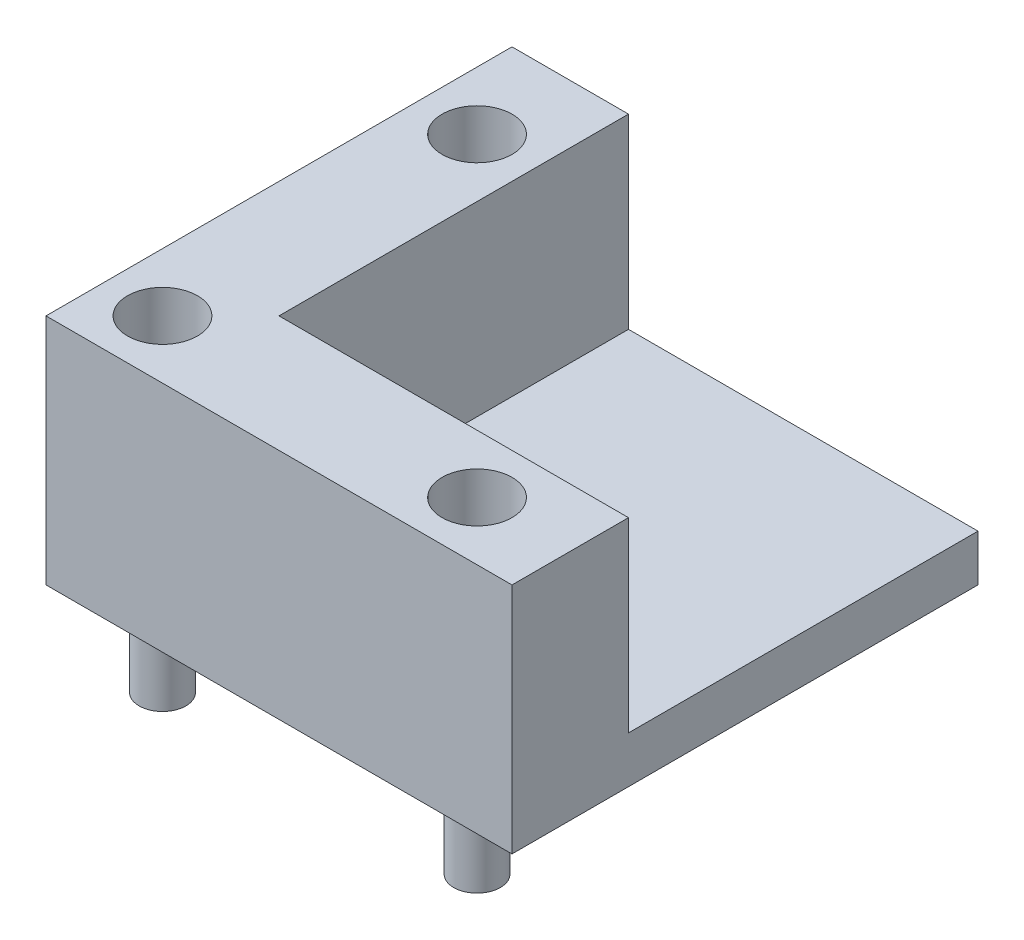
ISO-10303-21;
HEADER;
FILE_DESCRIPTION(('STEP AP214'),'2;1');
FILE_NAME('part.step','',(''),(''),'','','');
FILE_SCHEMA(('AUTOMOTIVE_DESIGN { 1 0 10303 214 1 1 1 1 }'));
ENDSEC;
DATA;
#1=APPLICATION_CONTEXT('core data for automotive mechanical design processes');
#2=APPLICATION_PROTOCOL_DEFINITION('international standard','automotive_design',2000,#1);
#3=PRODUCT_CONTEXT('',#1,'mechanical');
#4=PRODUCT('Part','Part','',(#3));
#5=PRODUCT_RELATED_PRODUCT_CATEGORY('part','',(#4));
#6=PRODUCT_DEFINITION_FORMATION('','',#4);
#7=PRODUCT_DEFINITION_CONTEXT('part definition',#1,'design');
#8=PRODUCT_DEFINITION('design','',#6,#7);
#9=PRODUCT_DEFINITION_SHAPE('','',#8);
#10=(LENGTH_UNIT() NAMED_UNIT(*) SI_UNIT(.MILLI.,.METRE.));
#11=(NAMED_UNIT(*) PLANE_ANGLE_UNIT() SI_UNIT($,.RADIAN.));
#12=(NAMED_UNIT(*) SI_UNIT($,.STERADIAN.) SOLID_ANGLE_UNIT());
#13=UNCERTAINTY_MEASURE_WITH_UNIT(LENGTH_MEASURE(1.E-05),#10,'distance_accuracy_value','');
#14=(GEOMETRIC_REPRESENTATION_CONTEXT(3) GLOBAL_UNCERTAINTY_ASSIGNED_CONTEXT((#13)) GLOBAL_UNIT_ASSIGNED_CONTEXT((#10,
#11,#12)) REPRESENTATION_CONTEXT('',''));
#15=CARTESIAN_POINT('',(0.,0.,0.));
#16=DIRECTION('',(0.,0.,1.));
#17=DIRECTION('',(1.,0.,0.));
#18=AXIS2_PLACEMENT_3D('',#15,#16,#17);
#19=CARTESIAN_POINT('',(0.,2.54,0.));
#20=DIRECTION('',(0.,-1.,0.));
#21=DIRECTION('',(0.,0.,-1.));
#22=AXIS2_PLACEMENT_3D('',#19,#20,#21);
#23=PLANE('',#22);
#24=DIRECTION('',(0.,0.,-1.));
#25=VECTOR('',#24,1.);
#26=CARTESIAN_POINT('',(6.35,2.54,-25.4));
#27=LINE('',#26,#25);
#28=CARTESIAN_POINT('',(6.35,2.54,-6.35));
#29=VERTEX_POINT('',#28);
#30=CARTESIAN_POINT('',(6.35,2.54,-25.4));
#31=VERTEX_POINT('',#30);
#32=EDGE_CURVE('E122',#29,#31,#27,.T.);
#33=ORIENTED_EDGE('',*,*,#32,.F.);
#34=DIRECTION('',(-1.,0.,0.));
#35=VECTOR('',#34,1.);
#36=CARTESIAN_POINT('',(6.35,2.54,-6.35));
#37=LINE('',#36,#35);
#38=CARTESIAN_POINT('',(25.4,2.54,-6.35));
#39=VERTEX_POINT('',#38);
#40=EDGE_CURVE('E59',#39,#29,#37,.T.);
#41=ORIENTED_EDGE('',*,*,#40,.F.);
#42=DIRECTION('',(0.,0.,-1.));
#43=VECTOR('',#42,1.);
#44=CARTESIAN_POINT('',(25.4,2.54,0.));
#45=LINE('',#44,#43);
#46=CARTESIAN_POINT('',(25.4,2.54,-25.4));
#47=VERTEX_POINT('',#46);
#48=EDGE_CURVE('E146',#39,#47,#45,.T.);
#49=ORIENTED_EDGE('',*,*,#48,.T.);
#50=DIRECTION('',(-1.,0.,0.));
#51=VECTOR('',#50,1.);
#52=CARTESIAN_POINT('',(0.,2.54,-25.4));
#53=LINE('',#52,#51);
#54=EDGE_CURVE('E54',#47,#31,#53,.T.);
#55=ORIENTED_EDGE('',*,*,#54,.T.);
#56=EDGE_LOOP('',(#33,#41,#49,#55));
#57=FACE_BOUND('',#56,.T.);
#58=ADVANCED_FACE('F39',(#57),#23,.F.);
#59=CARTESIAN_POINT('',(0.,2.54,0.));
#60=DIRECTION('',(1.,0.,0.));
#61=DIRECTION('',(0.,0.,-1.));
#62=AXIS2_PLACEMENT_3D('',#59,#60,#61);
#63=PLANE('',#62);
#64=DIRECTION('',(0.,0.,1.));
#65=VECTOR('',#64,1.);
#66=CARTESIAN_POINT('',(0.,0.,0.));
#67=LINE('',#66,#65);
#68=CARTESIAN_POINT('',(0.,0.,-25.4));
#69=VERTEX_POINT('',#68);
#70=CARTESIAN_POINT('',(0.,0.,0.));
#71=VERTEX_POINT('',#70);
#72=EDGE_CURVE('E145',#69,#71,#67,.T.);
#73=ORIENTED_EDGE('',*,*,#72,.T.);
#74=DIRECTION('',(0.,-1.,0.));
#75=VECTOR('',#74,1.);
#76=CARTESIAN_POINT('',(0.,2.54,0.));
#77=LINE('',#76,#75);
#78=CARTESIAN_POINT('',(0.,12.7,0.));
#79=VERTEX_POINT('',#78);
#80=EDGE_CURVE('E11',#79,#71,#77,.T.);
#81=ORIENTED_EDGE('',*,*,#80,.F.);
#82=DIRECTION('',(0.,0.,1.));
#83=VECTOR('',#82,1.);
#84=CARTESIAN_POINT('',(0.,12.7,-25.4));
#85=LINE('',#84,#83);
#86=CARTESIAN_POINT('',(0.,12.7,-25.4));
#87=VERTEX_POINT('',#86);
#88=EDGE_CURVE('E112',#87,#79,#85,.T.);
#89=ORIENTED_EDGE('',*,*,#88,.F.);
#90=DIRECTION('',(0.,-1.,0.));
#91=VECTOR('',#90,1.);
#92=CARTESIAN_POINT('',(0.,2.54,-25.4));
#93=LINE('',#92,#91);
#94=EDGE_CURVE('E97',#87,#69,#93,.T.);
#95=ORIENTED_EDGE('',*,*,#94,.T.);
#96=EDGE_LOOP('',(#73,#81,#89,#95));
#97=FACE_BOUND('',#96,.T.);
#98=ADVANCED_FACE('F41',(#97),#63,.F.);
#99=CARTESIAN_POINT('',(0.,2.54,0.));
#100=DIRECTION('',(0.,0.,-1.));
#101=DIRECTION('',(-1.,0.,0.));
#102=AXIS2_PLACEMENT_3D('',#99,#100,#101);
#103=PLANE('',#102);
#104=DIRECTION('',(1.,0.,0.));
#105=VECTOR('',#104,1.);
#106=CARTESIAN_POINT('',(0.,0.,0.));
#107=LINE('',#106,#105);
#108=CARTESIAN_POINT('',(25.4,0.,0.));
#109=VERTEX_POINT('',#108);
#110=EDGE_CURVE('E150',#71,#109,#107,.T.);
#111=ORIENTED_EDGE('',*,*,#110,.T.);
#112=DIRECTION('',(0.,-1.,0.));
#113=VECTOR('',#112,1.);
#114=CARTESIAN_POINT('',(25.4,2.54,0.));
#115=LINE('',#114,#113);
#116=CARTESIAN_POINT('',(25.4,12.7,0.));
#117=VERTEX_POINT('',#116);
#118=EDGE_CURVE('E47',#117,#109,#115,.T.);
#119=ORIENTED_EDGE('',*,*,#118,.F.);
#120=DIRECTION('',(1.,0.,0.));
#121=VECTOR('',#120,1.);
#122=CARTESIAN_POINT('',(0.,12.7,0.));
#123=LINE('',#122,#121);
#124=EDGE_CURVE('E116',#79,#117,#123,.T.);
#125=ORIENTED_EDGE('',*,*,#124,.F.);
#126=ORIENTED_EDGE('',*,*,#80,.T.);
#127=EDGE_LOOP('',(#111,#119,#125,#126));
#128=FACE_BOUND('',#127,.T.);
#129=ADVANCED_FACE('F165',(#128),#103,.F.);
#130=CARTESIAN_POINT('',(25.4,2.54,0.));
#131=DIRECTION('',(-1.,0.,0.));
#132=DIRECTION('',(0.,0.,1.));
#133=AXIS2_PLACEMENT_3D('',#130,#131,#132);
#134=PLANE('',#133);
#135=DIRECTION('',(0.,0.,-1.));
#136=VECTOR('',#135,1.);
#137=CARTESIAN_POINT('',(25.4,0.,0.));
#138=LINE('',#137,#136);
#139=CARTESIAN_POINT('',(25.4,0.,-25.4));
#140=VERTEX_POINT('',#139);
#141=EDGE_CURVE('E152',#109,#140,#138,.T.);
#142=ORIENTED_EDGE('',*,*,#141,.T.);
#143=DIRECTION('',(0.,-1.,0.));
#144=VECTOR('',#143,1.);
#145=CARTESIAN_POINT('',(25.4,2.54,-25.4));
#146=LINE('',#145,#144);
#147=EDGE_CURVE('E109',#47,#140,#146,.T.);
#148=ORIENTED_EDGE('',*,*,#147,.F.);
#149=ORIENTED_EDGE('',*,*,#48,.F.);
#150=DIRECTION('',(0.,-1.,0.));
#151=VECTOR('',#150,1.);
#152=CARTESIAN_POINT('',(25.4,12.7,-6.35));
#153=LINE('',#152,#151);
#154=CARTESIAN_POINT('',(25.4,12.7,-6.35));
#155=VERTEX_POINT('',#154);
#156=EDGE_CURVE('E142',#155,#39,#153,.T.);
#157=ORIENTED_EDGE('',*,*,#156,.F.);
#158=DIRECTION('',(0.,0.,-1.));
#159=VECTOR('',#158,1.);
#160=CARTESIAN_POINT('',(25.4,12.7,0.));
#161=LINE('',#160,#159);
#162=EDGE_CURVE('E130',#117,#155,#161,.T.);
#163=ORIENTED_EDGE('',*,*,#162,.F.);
#164=ORIENTED_EDGE('',*,*,#118,.T.);
#165=EDGE_LOOP('',(#142,#148,#149,#157,#163,#164));
#166=FACE_BOUND('',#165,.T.);
#167=ADVANCED_FACE('F159',(#166),#134,.F.);
#168=CARTESIAN_POINT('',(0.,2.54,-25.4));
#169=DIRECTION('',(0.,0.,1.));
#170=DIRECTION('',(1.,0.,0.));
#171=AXIS2_PLACEMENT_3D('',#168,#169,#170);
#172=PLANE('',#171);
#173=DIRECTION('',(-1.,0.,0.));
#174=VECTOR('',#173,1.);
#175=CARTESIAN_POINT('',(0.,0.,-25.4));
#176=LINE('',#175,#174);
#177=EDGE_CURVE('E105',#140,#69,#176,.T.);
#178=ORIENTED_EDGE('',*,*,#177,.T.);
#179=ORIENTED_EDGE('',*,*,#94,.F.);
#180=DIRECTION('',(-1.,0.,0.));
#181=VECTOR('',#180,1.);
#182=CARTESIAN_POINT('',(0.,12.7,-25.4));
#183=LINE('',#182,#181);
#184=CARTESIAN_POINT('',(6.35,12.7,-25.4));
#185=VERTEX_POINT('',#184);
#186=EDGE_CURVE('E102',#185,#87,#183,.T.);
#187=ORIENTED_EDGE('',*,*,#186,.F.);
#188=DIRECTION('',(0.,-1.,0.));
#189=VECTOR('',#188,1.);
#190=CARTESIAN_POINT('',(6.35,12.7,-25.4));
#191=LINE('',#190,#189);
#192=EDGE_CURVE('E135',#185,#31,#191,.T.);
#193=ORIENTED_EDGE('',*,*,#192,.T.);
#194=ORIENTED_EDGE('',*,*,#54,.F.);
#195=ORIENTED_EDGE('',*,*,#147,.T.);
#196=EDGE_LOOP('',(#178,#179,#187,#193,#194,#195));
#197=FACE_BOUND('',#196,.T.);
#198=ADVANCED_FACE('F99',(#197),#172,.F.);
#199=CARTESIAN_POINT('',(0.,0.,0.));
#200=DIRECTION('',(0.,-1.,0.));
#201=DIRECTION('',(0.,0.,-1.));
#202=AXIS2_PLACEMENT_3D('',#199,#200,#201);
#203=PLANE('',#202);
#204=CARTESIAN_POINT('',(3.175,0.,-20.32));
#205=DIRECTION('',(0.,-1.,0.));
#206=DIRECTION('',(0.,0.,-1.));
#207=AXIS2_PLACEMENT_3D('',#204,#205,#206);
#208=CIRCLE('',#207,1.27);
#209=CARTESIAN_POINT('',(3.175,0.,-21.59));
#210=VERTEX_POINT('',#209);
#211=EDGE_CURVE('E380',#210,#210,#208,.T.);
#212=ORIENTED_EDGE('',*,*,#211,.F.);
#213=EDGE_LOOP('',(#212));
#214=FACE_BOUND('',#213,.T.);
#215=CARTESIAN_POINT('',(20.32,0.,-3.175));
#216=DIRECTION('',(0.,-1.,0.));
#217=DIRECTION('',(0.,0.,-1.));
#218=AXIS2_PLACEMENT_3D('',#215,#216,#217);
#219=CIRCLE('',#218,1.27);
#220=CARTESIAN_POINT('',(20.32,0.,-4.445));
#221=VERTEX_POINT('',#220);
#222=EDGE_CURVE('E379',#221,#221,#219,.T.);
#223=ORIENTED_EDGE('',*,*,#222,.F.);
#224=EDGE_LOOP('',(#223));
#225=FACE_BOUND('',#224,.T.);
#226=CARTESIAN_POINT('',(3.175,0.,-3.175));
#227=DIRECTION('',(0.,-1.,0.));
#228=DIRECTION('',(0.,0.,-1.));
#229=AXIS2_PLACEMENT_3D('',#226,#227,#228);
#230=CIRCLE('',#229,1.27);
#231=CARTESIAN_POINT('',(3.175,0.,-4.445));
#232=VERTEX_POINT('',#231);
#233=EDGE_CURVE('E389',#232,#232,#230,.T.);
#234=ORIENTED_EDGE('',*,*,#233,.F.);
#235=EDGE_LOOP('',(#234));
#236=FACE_BOUND('',#235,.T.);
#237=ORIENTED_EDGE('',*,*,#72,.F.);
#238=ORIENTED_EDGE('',*,*,#177,.F.);
#239=ORIENTED_EDGE('',*,*,#141,.F.);
#240=ORIENTED_EDGE('',*,*,#110,.F.);
#241=EDGE_LOOP('',(#237,#238,#239,#240));
#242=FACE_BOUND('',#241,.T.);
#243=ADVANCED_FACE('F164',(#214,#225,#236,#242),#203,.T.);
#244=CARTESIAN_POINT('',(6.35,12.7,-6.35));
#245=DIRECTION('',(0.,0.,1.));
#246=DIRECTION('',(1.,0.,0.));
#247=AXIS2_PLACEMENT_3D('',#244,#245,#246);
#248=PLANE('',#247);
#249=ORIENTED_EDGE('',*,*,#40,.T.);
#250=DIRECTION('',(0.,-1.,0.));
#251=VECTOR('',#250,1.);
#252=CARTESIAN_POINT('',(6.35,12.7,-6.35));
#253=LINE('',#252,#251);
#254=CARTESIAN_POINT('',(6.35,12.7,-6.35));
#255=VERTEX_POINT('',#254);
#256=EDGE_CURVE('E139',#255,#29,#253,.T.);
#257=ORIENTED_EDGE('',*,*,#256,.F.);
#258=DIRECTION('',(-1.,0.,0.));
#259=VECTOR('',#258,1.);
#260=CARTESIAN_POINT('',(6.35,12.7,-6.35));
#261=LINE('',#260,#259);
#262=EDGE_CURVE('E132',#155,#255,#261,.T.);
#263=ORIENTED_EDGE('',*,*,#262,.F.);
#264=ORIENTED_EDGE('',*,*,#156,.T.);
#265=EDGE_LOOP('',(#249,#257,#263,#264));
#266=FACE_BOUND('',#265,.T.);
#267=ADVANCED_FACE('F169',(#266),#248,.F.);
#268=CARTESIAN_POINT('',(6.35,12.7,-25.4));
#269=DIRECTION('',(-1.,0.,0.));
#270=DIRECTION('',(0.,0.,1.));
#271=AXIS2_PLACEMENT_3D('',#268,#269,#270);
#272=PLANE('',#271);
#273=ORIENTED_EDGE('',*,*,#32,.T.);
#274=ORIENTED_EDGE('',*,*,#192,.F.);
#275=DIRECTION('',(0.,0.,-1.));
#276=VECTOR('',#275,1.);
#277=CARTESIAN_POINT('',(6.35,12.7,-25.4));
#278=LINE('',#277,#276);
#279=EDGE_CURVE('E120',#255,#185,#278,.T.);
#280=ORIENTED_EDGE('',*,*,#279,.F.);
#281=ORIENTED_EDGE('',*,*,#256,.T.);
#282=EDGE_LOOP('',(#273,#274,#280,#281));
#283=FACE_BOUND('',#282,.T.);
#284=ADVANCED_FACE('F171',(#283),#272,.F.);
#285=CARTESIAN_POINT('',(0.,12.7,0.));
#286=DIRECTION('',(0.,-1.,0.));
#287=DIRECTION('',(0.,0.,-1.));
#288=AXIS2_PLACEMENT_3D('',#285,#286,#287);
#289=PLANE('',#288);
#290=CARTESIAN_POINT('',(3.175,12.7,-20.32));
#291=DIRECTION('',(0.,1.,0.));
#292=DIRECTION('',(0.,0.,1.));
#293=AXIS2_PLACEMENT_3D('',#290,#291,#292);
#294=CIRCLE('',#293,1.905);
#295=CARTESIAN_POINT('',(3.175,12.7,-18.415));
#296=VERTEX_POINT('',#295);
#297=EDGE_CURVE('E398',#296,#296,#294,.T.);
#298=ORIENTED_EDGE('',*,*,#297,.F.);
#299=EDGE_LOOP('',(#298));
#300=FACE_BOUND('',#299,.T.);
#301=CARTESIAN_POINT('',(3.175,12.7,-3.175));
#302=DIRECTION('',(0.,1.,0.));
#303=DIRECTION('',(0.,0.,1.));
#304=AXIS2_PLACEMENT_3D('',#301,#302,#303);
#305=CIRCLE('',#304,1.905);
#306=CARTESIAN_POINT('',(3.175,12.7,-1.27));
#307=VERTEX_POINT('',#306);
#308=EDGE_CURVE('E404',#307,#307,#305,.T.);
#309=ORIENTED_EDGE('',*,*,#308,.F.);
#310=EDGE_LOOP('',(#309));
#311=FACE_BOUND('',#310,.T.);
#312=CARTESIAN_POINT('',(20.32,12.7,-3.175));
#313=DIRECTION('',(0.,1.,0.));
#314=DIRECTION('',(0.,0.,1.));
#315=AXIS2_PLACEMENT_3D('',#312,#313,#314);
#316=CIRCLE('',#315,1.905);
#317=CARTESIAN_POINT('',(20.32,12.7,-1.27));
#318=VERTEX_POINT('',#317);
#319=EDGE_CURVE('E126',#318,#318,#316,.T.);
#320=ORIENTED_EDGE('',*,*,#319,.F.);
#321=EDGE_LOOP('',(#320));
#322=FACE_BOUND('',#321,.T.);
#323=ORIENTED_EDGE('',*,*,#186,.T.);
#324=ORIENTED_EDGE('',*,*,#88,.T.);
#325=ORIENTED_EDGE('',*,*,#124,.T.);
#326=ORIENTED_EDGE('',*,*,#162,.T.);
#327=ORIENTED_EDGE('',*,*,#262,.T.);
#328=ORIENTED_EDGE('',*,*,#279,.T.);
#329=EDGE_LOOP('',(#323,#324,#325,#326,#327,#328));
#330=FACE_BOUND('',#329,.T.);
#331=ADVANCED_FACE('F118',(#300,#311,#322,#330),#289,.F.);
#332=CARTESIAN_POINT('',(20.32,6.35,-3.175));
#333=DIRECTION('',(0.,1.,0.));
#334=DIRECTION('',(0.,0.,1.));
#335=AXIS2_PLACEMENT_3D('',#332,#333,#334);
#336=CYLINDRICAL_SURFACE('',#335,1.905);
#337=CARTESIAN_POINT('',(20.32,6.35,-3.175));
#338=DIRECTION('',(0.,1.,0.));
#339=DIRECTION('',(0.,0.,1.));
#340=AXIS2_PLACEMENT_3D('',#337,#338,#339);
#341=CIRCLE('',#340,1.905);
#342=CARTESIAN_POINT('',(20.32,6.35,-1.27));
#343=VERTEX_POINT('',#342);
#344=EDGE_CURVE('E406',#343,#343,#341,.T.);
#345=ORIENTED_EDGE('',*,*,#344,.F.);
#346=EDGE_LOOP('',(#345));
#347=FACE_BOUND('',#346,.T.);
#348=ORIENTED_EDGE('',*,*,#319,.T.);
#349=EDGE_LOOP('',(#348));
#350=FACE_BOUND('',#349,.T.);
#351=ADVANCED_FACE('F225',(#347,#350),#336,.F.);
#352=CARTESIAN_POINT('',(20.32,6.35,-3.175));
#353=DIRECTION('',(0.,1.,0.));
#354=DIRECTION('',(0.,0.,1.));
#355=AXIS2_PLACEMENT_3D('',#352,#353,#354);
#356=PLANE('',#355);
#357=ORIENTED_EDGE('',*,*,#344,.T.);
#358=EDGE_LOOP('',(#357));
#359=FACE_BOUND('',#358,.T.);
#360=ADVANCED_FACE('F233',(#359),#356,.T.);
#361=CARTESIAN_POINT('',(3.175,6.35,-3.175));
#362=DIRECTION('',(0.,1.,0.));
#363=DIRECTION('',(0.,0.,1.));
#364=AXIS2_PLACEMENT_3D('',#361,#362,#363);
#365=CYLINDRICAL_SURFACE('',#364,1.905);
#366=CARTESIAN_POINT('',(3.175,6.35,-3.175));
#367=DIRECTION('',(0.,1.,0.));
#368=DIRECTION('',(0.,0.,1.));
#369=AXIS2_PLACEMENT_3D('',#366,#367,#368);
#370=CIRCLE('',#369,1.905);
#371=CARTESIAN_POINT('',(3.175,6.35,-1.27));
#372=VERTEX_POINT('',#371);
#373=EDGE_CURVE('E401',#372,#372,#370,.T.);
#374=ORIENTED_EDGE('',*,*,#373,.F.);
#375=EDGE_LOOP('',(#374));
#376=FACE_BOUND('',#375,.T.);
#377=ORIENTED_EDGE('',*,*,#308,.T.);
#378=EDGE_LOOP('',(#377));
#379=FACE_BOUND('',#378,.T.);
#380=ADVANCED_FACE('F241',(#376,#379),#365,.F.);
#381=CARTESIAN_POINT('',(3.175,6.35,-3.175));
#382=DIRECTION('',(0.,1.,0.));
#383=DIRECTION('',(0.,0.,1.));
#384=AXIS2_PLACEMENT_3D('',#381,#382,#383);
#385=PLANE('',#384);
#386=ORIENTED_EDGE('',*,*,#373,.T.);
#387=EDGE_LOOP('',(#386));
#388=FACE_BOUND('',#387,.T.);
#389=ADVANCED_FACE('F249',(#388),#385,.T.);
#390=CARTESIAN_POINT('',(3.175,6.35,-20.32));
#391=DIRECTION('',(0.,1.,0.));
#392=DIRECTION('',(0.,0.,1.));
#393=AXIS2_PLACEMENT_3D('',#390,#391,#392);
#394=CYLINDRICAL_SURFACE('',#393,1.905);
#395=CARTESIAN_POINT('',(3.175,6.35,-20.32));
#396=DIRECTION('',(0.,1.,0.));
#397=DIRECTION('',(0.,0.,1.));
#398=AXIS2_PLACEMENT_3D('',#395,#396,#397);
#399=CIRCLE('',#398,1.905);
#400=CARTESIAN_POINT('',(3.175,6.35,-18.415));
#401=VERTEX_POINT('',#400);
#402=EDGE_CURVE('E136',#401,#401,#399,.T.);
#403=ORIENTED_EDGE('',*,*,#402,.F.);
#404=EDGE_LOOP('',(#403));
#405=FACE_BOUND('',#404,.T.);
#406=ORIENTED_EDGE('',*,*,#297,.T.);
#407=EDGE_LOOP('',(#406));
#408=FACE_BOUND('',#407,.T.);
#409=ADVANCED_FACE('F257',(#405,#408),#394,.F.);
#410=CARTESIAN_POINT('',(3.175,6.35,-20.32));
#411=DIRECTION('',(0.,1.,0.));
#412=DIRECTION('',(0.,0.,1.));
#413=AXIS2_PLACEMENT_3D('',#410,#411,#412);
#414=PLANE('',#413);
#415=ORIENTED_EDGE('',*,*,#402,.T.);
#416=EDGE_LOOP('',(#415));
#417=FACE_BOUND('',#416,.T.);
#418=ADVANCED_FACE('F265',(#417),#414,.T.);
#419=CARTESIAN_POINT('',(3.175,-5.08,-3.175));
#420=DIRECTION('',(0.,1.,0.));
#421=DIRECTION('',(0.,0.,1.));
#422=AXIS2_PLACEMENT_3D('',#419,#420,#421);
#423=CYLINDRICAL_SURFACE('',#422,1.27);
#424=CARTESIAN_POINT('',(3.175,-5.08,-3.175));
#425=DIRECTION('',(0.,-1.,0.));
#426=DIRECTION('',(0.,0.,-1.));
#427=AXIS2_PLACEMENT_3D('',#424,#425,#426);
#428=CIRCLE('',#427,1.27);
#429=CARTESIAN_POINT('',(3.175,-5.08,-4.445));
#430=VERTEX_POINT('',#429);
#431=EDGE_CURVE('E391',#430,#430,#428,.T.);
#432=ORIENTED_EDGE('',*,*,#431,.F.);
#433=EDGE_LOOP('',(#432));
#434=FACE_BOUND('',#433,.T.);
#435=ORIENTED_EDGE('',*,*,#233,.T.);
#436=EDGE_LOOP('',(#435));
#437=FACE_BOUND('',#436,.T.);
#438=ADVANCED_FACE('F272',(#434,#437),#423,.T.);
#439=CARTESIAN_POINT('',(3.175,-5.08,-3.175));
#440=DIRECTION('',(0.,-1.,0.));
#441=DIRECTION('',(0.,0.,-1.));
#442=AXIS2_PLACEMENT_3D('',#439,#440,#441);
#443=PLANE('',#442);
#444=ORIENTED_EDGE('',*,*,#431,.T.);
#445=EDGE_LOOP('',(#444));
#446=FACE_BOUND('',#445,.T.);
#447=ADVANCED_FACE('F279',(#446),#443,.T.);
#448=CARTESIAN_POINT('',(20.32,-5.08,-3.175));
#449=DIRECTION('',(0.,1.,0.));
#450=DIRECTION('',(0.,0.,1.));
#451=AXIS2_PLACEMENT_3D('',#448,#449,#450);
#452=CYLINDRICAL_SURFACE('',#451,1.27);
#453=CARTESIAN_POINT('',(20.32,-5.08,-3.175));
#454=DIRECTION('',(0.,-1.,0.));
#455=DIRECTION('',(0.,0.,-1.));
#456=AXIS2_PLACEMENT_3D('',#453,#454,#455);
#457=CIRCLE('',#456,1.27);
#458=CARTESIAN_POINT('',(20.32,-5.08,-4.445));
#459=VERTEX_POINT('',#458);
#460=EDGE_CURVE('E383',#459,#459,#457,.T.);
#461=ORIENTED_EDGE('',*,*,#460,.F.);
#462=EDGE_LOOP('',(#461));
#463=FACE_BOUND('',#462,.T.);
#464=ORIENTED_EDGE('',*,*,#222,.T.);
#465=EDGE_LOOP('',(#464));
#466=FACE_BOUND('',#465,.T.);
#467=ADVANCED_FACE('F287',(#463,#466),#452,.T.);
#468=CARTESIAN_POINT('',(20.32,-5.08,-3.175));
#469=DIRECTION('',(0.,-1.,0.));
#470=DIRECTION('',(0.,0.,-1.));
#471=AXIS2_PLACEMENT_3D('',#468,#469,#470);
#472=PLANE('',#471);
#473=ORIENTED_EDGE('',*,*,#460,.T.);
#474=EDGE_LOOP('',(#473));
#475=FACE_BOUND('',#474,.T.);
#476=ADVANCED_FACE('F295',(#475),#472,.T.);
#477=CARTESIAN_POINT('',(3.175,-5.08,-20.32));
#478=DIRECTION('',(0.,1.,0.));
#479=DIRECTION('',(0.,0.,1.));
#480=AXIS2_PLACEMENT_3D('',#477,#478,#479);
#481=CYLINDRICAL_SURFACE('',#480,1.27);
#482=CARTESIAN_POINT('',(3.175,-5.08,-20.32));
#483=DIRECTION('',(0.,-1.,0.));
#484=DIRECTION('',(0.,0.,-1.));
#485=AXIS2_PLACEMENT_3D('',#482,#483,#484);
#486=CIRCLE('',#485,1.27);
#487=CARTESIAN_POINT('',(3.175,-5.08,-21.59));
#488=VERTEX_POINT('',#487);
#489=EDGE_CURVE('E378',#488,#488,#486,.T.);
#490=ORIENTED_EDGE('',*,*,#489,.F.);
#491=EDGE_LOOP('',(#490));
#492=FACE_BOUND('',#491,.T.);
#493=ORIENTED_EDGE('',*,*,#211,.T.);
#494=EDGE_LOOP('',(#493));
#495=FACE_BOUND('',#494,.T.);
#496=ADVANCED_FACE('F303',(#492,#495),#481,.T.);
#497=CARTESIAN_POINT('',(3.175,-5.08,-20.32));
#498=DIRECTION('',(0.,-1.,0.));
#499=DIRECTION('',(0.,0.,-1.));
#500=AXIS2_PLACEMENT_3D('',#497,#498,#499);
#501=PLANE('',#500);
#502=ORIENTED_EDGE('',*,*,#489,.T.);
#503=EDGE_LOOP('',(#502));
#504=FACE_BOUND('',#503,.T.);
#505=ADVANCED_FACE('F311',(#504),#501,.T.);
#506=CLOSED_SHELL('',(#58,#98,#129,#167,#198,#243,#267,#284,#331,#351,#360,#380,#389,#409,#418,
#438,#447,#467,#476,#496,#505));
#507=MANIFOLD_SOLID_BREP('B2',#506);
#508=ADVANCED_BREP_SHAPE_REPRESENTATION('',(#18,#507),#14);
#509=SHAPE_DEFINITION_REPRESENTATION(#9,#508);
ENDSEC;
END-ISO-10303-21;
